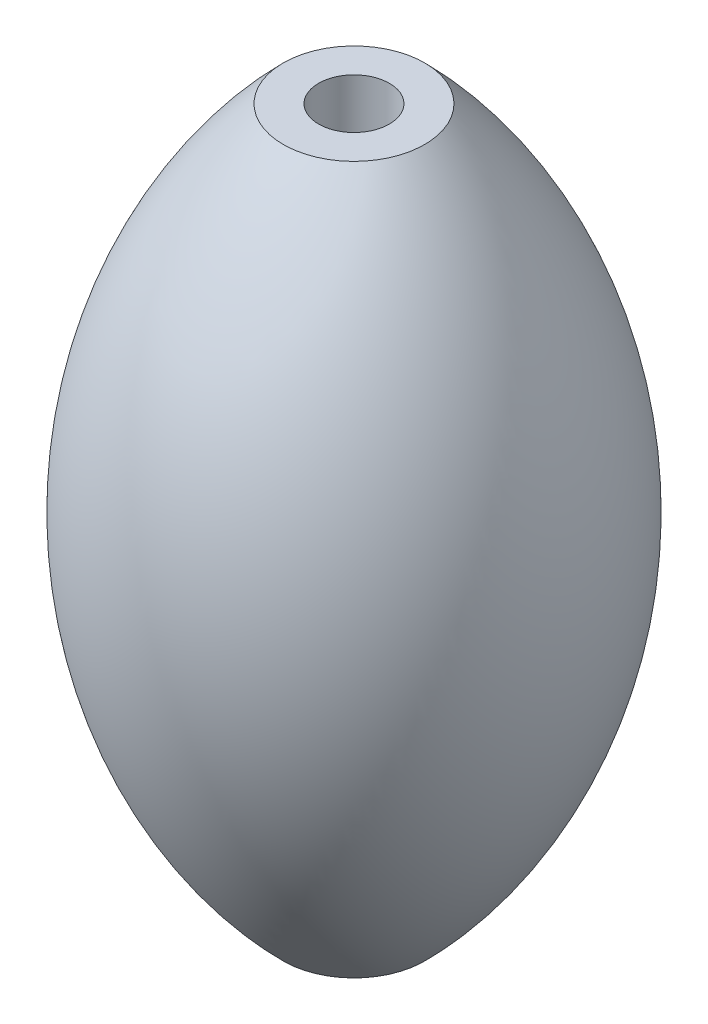
ISO-10303-21;
HEADER;
FILE_DESCRIPTION(('STEP AP214'),'2;1');
FILE_NAME('part.step','',(''),(''),'','','');
FILE_SCHEMA(('AUTOMOTIVE_DESIGN { 1 0 10303 214 1 1 1 1 }'));
ENDSEC;
DATA;
#1=APPLICATION_CONTEXT('core data for automotive mechanical design processes');
#2=APPLICATION_PROTOCOL_DEFINITION('international standard','automotive_design',2000,#1);
#3=PRODUCT_CONTEXT('',#1,'mechanical');
#4=PRODUCT('Part','Part','',(#3));
#5=PRODUCT_RELATED_PRODUCT_CATEGORY('part','',(#4));
#6=PRODUCT_DEFINITION_FORMATION('','',#4);
#7=PRODUCT_DEFINITION_CONTEXT('part definition',#1,'design');
#8=PRODUCT_DEFINITION('design','',#6,#7);
#9=PRODUCT_DEFINITION_SHAPE('','',#8);
#10=(LENGTH_UNIT() NAMED_UNIT(*) SI_UNIT(.MILLI.,.METRE.));
#11=(NAMED_UNIT(*) PLANE_ANGLE_UNIT() SI_UNIT($,.RADIAN.));
#12=(NAMED_UNIT(*) SI_UNIT($,.STERADIAN.) SOLID_ANGLE_UNIT());
#13=UNCERTAINTY_MEASURE_WITH_UNIT(LENGTH_MEASURE(1.E-05),#10,'distance_accuracy_value','');
#14=(GEOMETRIC_REPRESENTATION_CONTEXT(3) GLOBAL_UNCERTAINTY_ASSIGNED_CONTEXT((#13)) GLOBAL_UNIT_ASSIGNED_CONTEXT((#10,
#11,#12)) REPRESENTATION_CONTEXT('',''));
#15=CARTESIAN_POINT('',(0.,0.,0.));
#16=DIRECTION('',(0.,0.,1.));
#17=DIRECTION('',(1.,0.,0.));
#18=AXIS2_PLACEMENT_3D('',#15,#16,#17);
#19=CARTESIAN_POINT('',(0.,0.,0.));
#20=DIRECTION('',(0.,1.,0.));
#21=DIRECTION('',(-1.,0.,0.));
#22=AXIS2_PLACEMENT_3D('',#19,#20,#21);
#23=DEGENERATE_TOROIDAL_SURFACE('',#22,4.00000000000001,7.07106781186548,.F.);
#24=CARTESIAN_POINT('',(0.,-5.,0.));
#25=DIRECTION('',(0.,1.,0.));
#26=DIRECTION('',(-1.,0.,0.));
#27=AXIS2_PLACEMENT_3D('',#24,#25,#26);
#28=CIRCLE('',#27,1.);
#29=CARTESIAN_POINT('',(-0.999999999999999,-5.,0.));
#30=VERTEX_POINT('',#29);
#31=EDGE_CURVE('E39',#30,#30,#28,.T.);
#32=ORIENTED_EDGE('',*,*,#31,.T.);
#33=EDGE_LOOP('',(#32));
#34=FACE_BOUND('',#33,.T.);
#35=CARTESIAN_POINT('',(0.,5.,0.));
#36=DIRECTION('',(0.,1.,0.));
#37=DIRECTION('',(-1.,0.,0.));
#38=AXIS2_PLACEMENT_3D('',#35,#36,#37);
#39=CIRCLE('',#38,1.);
#40=CARTESIAN_POINT('',(-1.,5.,0.));
#41=VERTEX_POINT('',#40);
#42=EDGE_CURVE('E10',#41,#41,#39,.T.);
#43=ORIENTED_EDGE('',*,*,#42,.F.);
#44=EDGE_LOOP('',(#43));
#45=FACE_BOUND('',#44,.T.);
#46=ADVANCED_FACE('F33',(#34,#45),#23,.F.);
#47=CARTESIAN_POINT('',(0.,5.,0.));
#48=DIRECTION('',(0.,1.,0.));
#49=DIRECTION('',(-1.,0.,0.));
#50=AXIS2_PLACEMENT_3D('',#47,#48,#49);
#51=PLANE('',#50);
#52=CARTESIAN_POINT('',(0.,5.,0.));
#53=DIRECTION('',(0.,1.,0.));
#54=DIRECTION('',(-1.,0.,0.));
#55=AXIS2_PLACEMENT_3D('',#52,#53,#54);
#56=CIRCLE('',#55,0.5);
#57=CARTESIAN_POINT('',(-0.500000000000002,5.,0.));
#58=VERTEX_POINT('',#57);
#59=EDGE_CURVE('E47',#58,#58,#56,.T.);
#60=ORIENTED_EDGE('',*,*,#59,.F.);
#61=EDGE_LOOP('',(#60));
#62=FACE_BOUND('',#61,.T.);
#63=ORIENTED_EDGE('',*,*,#42,.T.);
#64=EDGE_LOOP('',(#63));
#65=FACE_BOUND('',#64,.T.);
#66=ADVANCED_FACE('F55',(#62,#65),#51,.T.);
#67=CARTESIAN_POINT('',(0.,-5.,0.));
#68=DIRECTION('',(0.,1.,0.));
#69=DIRECTION('',(-1.,0.,0.));
#70=AXIS2_PLACEMENT_3D('',#67,#68,#69);
#71=PLANE('',#70);
#72=CARTESIAN_POINT('',(0.,-5.,0.));
#73=DIRECTION('',(0.,1.,0.));
#74=DIRECTION('',(-1.,0.,0.));
#75=AXIS2_PLACEMENT_3D('',#72,#73,#74);
#76=CIRCLE('',#75,0.5);
#77=CARTESIAN_POINT('',(-0.499999999999999,-5.,0.));
#78=VERTEX_POINT('',#77);
#79=EDGE_CURVE('E43',#78,#78,#76,.T.);
#80=ORIENTED_EDGE('',*,*,#79,.T.);
#81=EDGE_LOOP('',(#80));
#82=FACE_BOUND('',#81,.T.);
#83=ORIENTED_EDGE('',*,*,#31,.F.);
#84=EDGE_LOOP('',(#83));
#85=FACE_BOUND('',#84,.T.);
#86=ADVANCED_FACE('F57',(#82,#85),#71,.F.);
#87=CARTESIAN_POINT('',(0.,-5.,0.));
#88=DIRECTION('',(0.,1.,0.));
#89=DIRECTION('',(-1.,0.,0.));
#90=AXIS2_PLACEMENT_3D('',#87,#88,#89);
#91=CYLINDRICAL_SURFACE('',#90,0.5);
#92=ORIENTED_EDGE('',*,*,#79,.F.);
#93=EDGE_LOOP('',(#92));
#94=FACE_BOUND('',#93,.T.);
#95=ORIENTED_EDGE('',*,*,#59,.T.);
#96=EDGE_LOOP('',(#95));
#97=FACE_BOUND('',#96,.T.);
#98=ADVANCED_FACE('F53',(#94,#97),#91,.F.);
#99=CLOSED_SHELL('',(#46,#66,#86,#98));
#100=MANIFOLD_SOLID_BREP('B2',#99);
#101=ADVANCED_BREP_SHAPE_REPRESENTATION('',(#18,#100),#14);
#102=SHAPE_DEFINITION_REPRESENTATION(#9,#101);
ENDSEC;
END-ISO-10303-21;
